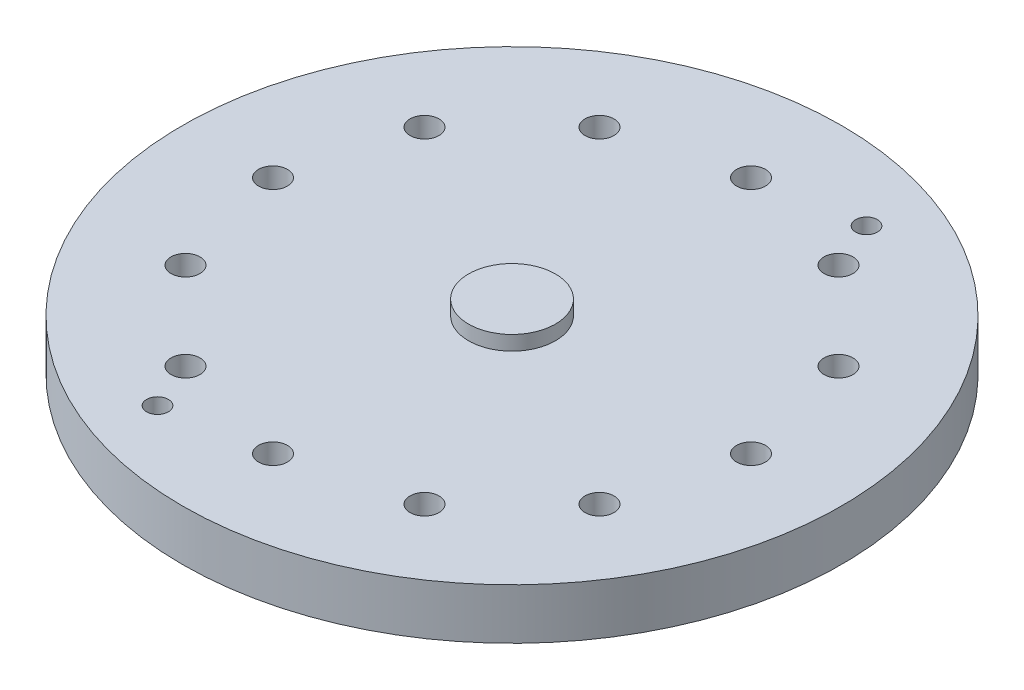
ISO-10303-21;
HEADER;
FILE_DESCRIPTION(('STEP AP214'),'2;1');
FILE_NAME('part.step','',(''),(''),'','','');
FILE_SCHEMA(('AUTOMOTIVE_DESIGN { 1 0 10303 214 1 1 1 1 }'));
ENDSEC;
DATA;
#1=APPLICATION_CONTEXT('core data for automotive mechanical design processes');
#2=APPLICATION_PROTOCOL_DEFINITION('international standard','automotive_design',2000,#1);
#3=PRODUCT_CONTEXT('',#1,'mechanical');
#4=PRODUCT('Part','Part','',(#3));
#5=PRODUCT_RELATED_PRODUCT_CATEGORY('part','',(#4));
#6=PRODUCT_DEFINITION_FORMATION('','',#4);
#7=PRODUCT_DEFINITION_CONTEXT('part definition',#1,'design');
#8=PRODUCT_DEFINITION('design','',#6,#7);
#9=PRODUCT_DEFINITION_SHAPE('','',#8);
#10=(LENGTH_UNIT() NAMED_UNIT(*) SI_UNIT(.MILLI.,.METRE.));
#11=(NAMED_UNIT(*) PLANE_ANGLE_UNIT() SI_UNIT($,.RADIAN.));
#12=(NAMED_UNIT(*) SI_UNIT($,.STERADIAN.) SOLID_ANGLE_UNIT());
#13=UNCERTAINTY_MEASURE_WITH_UNIT(LENGTH_MEASURE(1.E-05),#10,'distance_accuracy_value','');
#14=(GEOMETRIC_REPRESENTATION_CONTEXT(3) GLOBAL_UNCERTAINTY_ASSIGNED_CONTEXT((#13)) GLOBAL_UNIT_ASSIGNED_CONTEXT((#10,
#11,#12)) REPRESENTATION_CONTEXT('',''));
#15=CARTESIAN_POINT('',(0.,0.,0.));
#16=DIRECTION('',(0.,0.,1.));
#17=DIRECTION('',(1.,0.,0.));
#18=AXIS2_PLACEMENT_3D('',#15,#16,#17);
#19=CARTESIAN_POINT('',(-6.12,9.,-6.12));
#20=DIRECTION('',(0.,1.,0.));
#21=DIRECTION('',(0.,0.,1.));
#22=AXIS2_PLACEMENT_3D('',#19,#20,#21);
#23=PLANE('',#22);
#24=CARTESIAN_POINT('',(0.,9.,0.));
#25=DIRECTION('',(0.,-1.,0.));
#26=DIRECTION('',(0.,0.,-1.));
#27=AXIS2_PLACEMENT_3D('',#24,#25,#26);
#28=CIRCLE('',#27,6.);
#29=CARTESIAN_POINT('',(0.,9.,-6.));
#30=VERTEX_POINT('',#29);
#31=EDGE_CURVE('E19',#30,#30,#28,.T.);
#32=ORIENTED_EDGE('',*,*,#31,.F.);
#33=EDGE_LOOP('',(#32));
#34=FACE_BOUND('',#33,.T.);
#35=ADVANCED_FACE('F15',(#34),#23,.T.);
#36=CARTESIAN_POINT('',(0.,7.,0.));
#37=DIRECTION('',(0.,-1.,0.));
#38=DIRECTION('',(0.,0.,-1.));
#39=AXIS2_PLACEMENT_3D('',#36,#37,#38);
#40=CYLINDRICAL_SURFACE('',#39,45.5);
#41=CARTESIAN_POINT('',(0.,0.,0.));
#42=DIRECTION('',(0.,-1.,0.));
#43=DIRECTION('',(0.,0.,-1.));
#44=AXIS2_PLACEMENT_3D('',#41,#42,#43);
#45=CIRCLE('',#44,45.5);
#46=CARTESIAN_POINT('',(0.,0.,-45.5));
#47=VERTEX_POINT('',#46);
#48=EDGE_CURVE('E113',#47,#47,#45,.T.);
#49=ORIENTED_EDGE('',*,*,#48,.F.);
#50=EDGE_LOOP('',(#49));
#51=FACE_BOUND('',#50,.T.);
#52=CARTESIAN_POINT('',(0.,7.,0.));
#53=DIRECTION('',(0.,-1.,0.));
#54=DIRECTION('',(0.,0.,-1.));
#55=AXIS2_PLACEMENT_3D('',#52,#53,#54);
#56=CIRCLE('',#55,45.5);
#57=CARTESIAN_POINT('',(0.,7.,-45.5));
#58=VERTEX_POINT('',#57);
#59=EDGE_CURVE('E72',#58,#58,#56,.F.);
#60=ORIENTED_EDGE('',*,*,#59,.F.);
#61=EDGE_LOOP('',(#60));
#62=FACE_BOUND('',#61,.T.);
#63=ADVANCED_FACE('F123',(#51,#62),#40,.T.);
#64=CARTESIAN_POINT('',(13.7259968078408,0.,-35.2198383248865));
#65=DIRECTION('',(0.,1.,0.));
#66=DIRECTION('',(0.,0.,1.));
#67=AXIS2_PLACEMENT_3D('',#64,#65,#66);
#68=CYLINDRICAL_SURFACE('',#67,1.5);
#69=CARTESIAN_POINT('',(13.7259968078408,7.,-35.2198383248865));
#70=DIRECTION('',(0.,1.,0.));
#71=DIRECTION('',(0.,0.,1.));
#72=AXIS2_PLACEMENT_3D('',#69,#70,#71);
#73=CIRCLE('',#72,1.5);
#74=CARTESIAN_POINT('',(13.7259968078408,7.,-33.7198383248865));
#75=VERTEX_POINT('',#74);
#76=EDGE_CURVE('E69',#75,#75,#73,.F.);
#77=ORIENTED_EDGE('',*,*,#76,.F.);
#78=EDGE_LOOP('',(#77));
#79=FACE_BOUND('',#78,.T.);
#80=CARTESIAN_POINT('',(13.7259968078408,0.,-35.2198383248865));
#81=DIRECTION('',(0.,1.,0.));
#82=DIRECTION('',(0.,0.,1.));
#83=AXIS2_PLACEMENT_3D('',#80,#81,#82);
#84=CIRCLE('',#83,1.5);
#85=CARTESIAN_POINT('',(13.7259968078408,0.,-33.7198383248865));
#86=VERTEX_POINT('',#85);
#87=EDGE_CURVE('E111',#86,#86,#84,.T.);
#88=ORIENTED_EDGE('',*,*,#87,.F.);
#89=EDGE_LOOP('',(#88));
#90=FACE_BOUND('',#89,.T.);
#91=ADVANCED_FACE('F129',(#79,#90),#68,.F.);
#92=CARTESIAN_POINT('',(28.5788383248865,0.,-16.5000000000001));
#93=DIRECTION('',(0.,1.,0.));
#94=DIRECTION('',(0.,0.,1.));
#95=AXIS2_PLACEMENT_3D('',#92,#93,#94);
#96=CYLINDRICAL_SURFACE('',#95,1.99999999999992);
#97=CARTESIAN_POINT('',(28.5788383248865,7.,-16.5000000000001));
#98=DIRECTION('',(0.,1.,0.));
#99=DIRECTION('',(0.,0.,1.));
#100=AXIS2_PLACEMENT_3D('',#97,#98,#99);
#101=CIRCLE('',#100,1.99999999999992);
#102=CARTESIAN_POINT('',(28.5788383248865,7.,-14.5000000000001));
#103=VERTEX_POINT('',#102);
#104=EDGE_CURVE('E66',#103,#103,#101,.F.);
#105=ORIENTED_EDGE('',*,*,#104,.F.);
#106=EDGE_LOOP('',(#105));
#107=FACE_BOUND('',#106,.T.);
#108=CARTESIAN_POINT('',(28.5788383248865,0.,-16.5000000000001));
#109=DIRECTION('',(0.,1.,0.));
#110=DIRECTION('',(0.,0.,1.));
#111=AXIS2_PLACEMENT_3D('',#108,#109,#110);
#112=CIRCLE('',#111,1.99999999999992);
#113=CARTESIAN_POINT('',(28.5788383248865,0.,-14.5000000000001));
#114=VERTEX_POINT('',#113);
#115=EDGE_CURVE('E108',#114,#114,#112,.T.);
#116=ORIENTED_EDGE('',*,*,#115,.F.);
#117=EDGE_LOOP('',(#116));
#118=FACE_BOUND('',#117,.T.);
#119=ADVANCED_FACE('F195',(#107,#118),#96,.F.);
#120=CARTESIAN_POINT('',(16.5,0.,-28.5788383248865));
#121=DIRECTION('',(0.,1.,0.));
#122=DIRECTION('',(0.,0.,1.));
#123=AXIS2_PLACEMENT_3D('',#120,#121,#122);
#124=CYLINDRICAL_SURFACE('',#123,2.00000000000002);
#125=CARTESIAN_POINT('',(16.5,7.,-28.5788383248865));
#126=DIRECTION('',(0.,1.,0.));
#127=DIRECTION('',(0.,0.,1.));
#128=AXIS2_PLACEMENT_3D('',#125,#126,#127);
#129=CIRCLE('',#128,2.00000000000002);
#130=CARTESIAN_POINT('',(16.5,7.,-26.5788383248865));
#131=VERTEX_POINT('',#130);
#132=EDGE_CURVE('E63',#131,#131,#129,.F.);
#133=ORIENTED_EDGE('',*,*,#132,.F.);
#134=EDGE_LOOP('',(#133));
#135=FACE_BOUND('',#134,.T.);
#136=CARTESIAN_POINT('',(16.5,0.,-28.5788383248865));
#137=DIRECTION('',(0.,1.,0.));
#138=DIRECTION('',(0.,0.,1.));
#139=AXIS2_PLACEMENT_3D('',#136,#137,#138);
#140=CIRCLE('',#139,2.00000000000002);
#141=CARTESIAN_POINT('',(16.5,0.,-26.5788383248865));
#142=VERTEX_POINT('',#141);
#143=EDGE_CURVE('E105',#142,#142,#140,.T.);
#144=ORIENTED_EDGE('',*,*,#143,.F.);
#145=EDGE_LOOP('',(#144));
#146=FACE_BOUND('',#145,.T.);
#147=ADVANCED_FACE('F191',(#135,#146),#124,.F.);
#148=CARTESIAN_POINT('',(0.,0.,-33.));
#149=DIRECTION('',(0.,1.,0.));
#150=DIRECTION('',(0.,0.,1.));
#151=AXIS2_PLACEMENT_3D('',#148,#149,#150);
#152=CYLINDRICAL_SURFACE('',#151,2.);
#153=CARTESIAN_POINT('',(0.,7.,-33.));
#154=DIRECTION('',(0.,1.,0.));
#155=DIRECTION('',(0.,0.,1.));
#156=AXIS2_PLACEMENT_3D('',#153,#154,#155);
#157=CIRCLE('',#156,2.);
#158=CARTESIAN_POINT('',(0.,7.,-31.));
#159=VERTEX_POINT('',#158);
#160=EDGE_CURVE('E60',#159,#159,#157,.F.);
#161=ORIENTED_EDGE('',*,*,#160,.F.);
#162=EDGE_LOOP('',(#161));
#163=FACE_BOUND('',#162,.T.);
#164=CARTESIAN_POINT('',(0.,0.,-33.));
#165=DIRECTION('',(0.,1.,0.));
#166=DIRECTION('',(0.,0.,1.));
#167=AXIS2_PLACEMENT_3D('',#164,#165,#166);
#168=CIRCLE('',#167,2.);
#169=CARTESIAN_POINT('',(0.,0.,-31.));
#170=VERTEX_POINT('',#169);
#171=EDGE_CURVE('E102',#170,#170,#168,.T.);
#172=ORIENTED_EDGE('',*,*,#171,.F.);
#173=EDGE_LOOP('',(#172));
#174=FACE_BOUND('',#173,.T.);
#175=ADVANCED_FACE('F187',(#163,#174),#152,.F.);
#176=CARTESIAN_POINT('',(-16.5000000000001,0.,-28.5788383248865));
#177=DIRECTION('',(0.,1.,0.));
#178=DIRECTION('',(0.,0.,1.));
#179=AXIS2_PLACEMENT_3D('',#176,#177,#178);
#180=CYLINDRICAL_SURFACE('',#179,1.99999999999992);
#181=CARTESIAN_POINT('',(-16.5000000000001,7.,-28.5788383248865));
#182=DIRECTION('',(0.,1.,0.));
#183=DIRECTION('',(0.,0.,1.));
#184=AXIS2_PLACEMENT_3D('',#181,#182,#183);
#185=CIRCLE('',#184,1.99999999999992);
#186=CARTESIAN_POINT('',(-16.5000000000001,7.,-26.5788383248866));
#187=VERTEX_POINT('',#186);
#188=EDGE_CURVE('E57',#187,#187,#185,.F.);
#189=ORIENTED_EDGE('',*,*,#188,.F.);
#190=EDGE_LOOP('',(#189));
#191=FACE_BOUND('',#190,.T.);
#192=CARTESIAN_POINT('',(-16.5000000000001,0.,-28.5788383248865));
#193=DIRECTION('',(0.,1.,0.));
#194=DIRECTION('',(0.,0.,1.));
#195=AXIS2_PLACEMENT_3D('',#192,#193,#194);
#196=CIRCLE('',#195,1.99999999999992);
#197=CARTESIAN_POINT('',(-16.5000000000001,0.,-26.5788383248866));
#198=VERTEX_POINT('',#197);
#199=EDGE_CURVE('E99',#198,#198,#196,.T.);
#200=ORIENTED_EDGE('',*,*,#199,.F.);
#201=EDGE_LOOP('',(#200));
#202=FACE_BOUND('',#201,.T.);
#203=ADVANCED_FACE('F183',(#191,#202),#180,.F.);
#204=CARTESIAN_POINT('',(-28.5788383248865,0.,-16.5));
#205=DIRECTION('',(0.,1.,0.));
#206=DIRECTION('',(0.,0.,1.));
#207=AXIS2_PLACEMENT_3D('',#204,#205,#206);
#208=CYLINDRICAL_SURFACE('',#207,2.00000000000002);
#209=CARTESIAN_POINT('',(-28.5788383248865,7.,-16.5));
#210=DIRECTION('',(0.,1.,0.));
#211=DIRECTION('',(0.,0.,1.));
#212=AXIS2_PLACEMENT_3D('',#209,#210,#211);
#213=CIRCLE('',#212,2.00000000000002);
#214=CARTESIAN_POINT('',(-28.5788383248865,7.,-14.5));
#215=VERTEX_POINT('',#214);
#216=EDGE_CURVE('E54',#215,#215,#213,.F.);
#217=ORIENTED_EDGE('',*,*,#216,.F.);
#218=EDGE_LOOP('',(#217));
#219=FACE_BOUND('',#218,.T.);
#220=CARTESIAN_POINT('',(-28.5788383248865,0.,-16.5));
#221=DIRECTION('',(0.,1.,0.));
#222=DIRECTION('',(0.,0.,1.));
#223=AXIS2_PLACEMENT_3D('',#220,#221,#222);
#224=CIRCLE('',#223,2.00000000000002);
#225=CARTESIAN_POINT('',(-28.5788383248865,0.,-14.5));
#226=VERTEX_POINT('',#225);
#227=EDGE_CURVE('E96',#226,#226,#224,.T.);
#228=ORIENTED_EDGE('',*,*,#227,.F.);
#229=EDGE_LOOP('',(#228));
#230=FACE_BOUND('',#229,.T.);
#231=ADVANCED_FACE('F179',(#219,#230),#208,.F.);
#232=CARTESIAN_POINT('',(-33.,0.,0.));
#233=DIRECTION('',(0.,1.,0.));
#234=DIRECTION('',(0.,0.,1.));
#235=AXIS2_PLACEMENT_3D('',#232,#233,#234);
#236=CYLINDRICAL_SURFACE('',#235,2.);
#237=CARTESIAN_POINT('',(-33.,7.,0.));
#238=DIRECTION('',(0.,1.,0.));
#239=DIRECTION('',(0.,0.,1.));
#240=AXIS2_PLACEMENT_3D('',#237,#238,#239);
#241=CIRCLE('',#240,2.);
#242=CARTESIAN_POINT('',(-33.,7.,2.00000000000001));
#243=VERTEX_POINT('',#242);
#244=EDGE_CURVE('E51',#243,#243,#241,.F.);
#245=ORIENTED_EDGE('',*,*,#244,.F.);
#246=EDGE_LOOP('',(#245));
#247=FACE_BOUND('',#246,.T.);
#248=CARTESIAN_POINT('',(-33.,0.,0.));
#249=DIRECTION('',(0.,1.,0.));
#250=DIRECTION('',(0.,0.,1.));
#251=AXIS2_PLACEMENT_3D('',#248,#249,#250);
#252=CIRCLE('',#251,2.);
#253=CARTESIAN_POINT('',(-33.,0.,2.00000000000001));
#254=VERTEX_POINT('',#253);
#255=EDGE_CURVE('E93',#254,#254,#252,.T.);
#256=ORIENTED_EDGE('',*,*,#255,.F.);
#257=EDGE_LOOP('',(#256));
#258=FACE_BOUND('',#257,.T.);
#259=ADVANCED_FACE('F175',(#247,#258),#236,.F.);
#260=CARTESIAN_POINT('',(-28.5788383248865,0.,16.5000000000001));
#261=DIRECTION('',(0.,1.,0.));
#262=DIRECTION('',(0.,0.,1.));
#263=AXIS2_PLACEMENT_3D('',#260,#261,#262);
#264=CYLINDRICAL_SURFACE('',#263,1.99999999999992);
#265=CARTESIAN_POINT('',(-28.5788383248865,7.,16.5000000000001));
#266=DIRECTION('',(0.,1.,0.));
#267=DIRECTION('',(0.,0.,1.));
#268=AXIS2_PLACEMENT_3D('',#265,#266,#267);
#269=CIRCLE('',#268,1.99999999999992);
#270=CARTESIAN_POINT('',(-28.5788383248865,7.,18.5));
#271=VERTEX_POINT('',#270);
#272=EDGE_CURVE('E48',#271,#271,#269,.F.);
#273=ORIENTED_EDGE('',*,*,#272,.F.);
#274=EDGE_LOOP('',(#273));
#275=FACE_BOUND('',#274,.T.);
#276=CARTESIAN_POINT('',(-28.5788383248865,0.,16.5000000000001));
#277=DIRECTION('',(0.,1.,0.));
#278=DIRECTION('',(0.,0.,1.));
#279=AXIS2_PLACEMENT_3D('',#276,#277,#278);
#280=CIRCLE('',#279,1.99999999999992);
#281=CARTESIAN_POINT('',(-28.5788383248865,0.,18.5));
#282=VERTEX_POINT('',#281);
#283=EDGE_CURVE('E90',#282,#282,#280,.T.);
#284=ORIENTED_EDGE('',*,*,#283,.F.);
#285=EDGE_LOOP('',(#284));
#286=FACE_BOUND('',#285,.T.);
#287=ADVANCED_FACE('F171',(#275,#286),#264,.F.);
#288=CARTESIAN_POINT('',(-16.5,0.,28.5788383248865));
#289=DIRECTION('',(0.,1.,0.));
#290=DIRECTION('',(0.,0.,1.));
#291=AXIS2_PLACEMENT_3D('',#288,#289,#290);
#292=CYLINDRICAL_SURFACE('',#291,2.00000000000002);
#293=CARTESIAN_POINT('',(-16.5,7.,28.5788383248865));
#294=DIRECTION('',(0.,1.,0.));
#295=DIRECTION('',(0.,0.,1.));
#296=AXIS2_PLACEMENT_3D('',#293,#294,#295);
#297=CIRCLE('',#296,2.00000000000002);
#298=CARTESIAN_POINT('',(-16.5,7.,30.5788383248865));
#299=VERTEX_POINT('',#298);
#300=EDGE_CURVE('E45',#299,#299,#297,.F.);
#301=ORIENTED_EDGE('',*,*,#300,.F.);
#302=EDGE_LOOP('',(#301));
#303=FACE_BOUND('',#302,.T.);
#304=CARTESIAN_POINT('',(-16.5,0.,28.5788383248865));
#305=DIRECTION('',(0.,1.,0.));
#306=DIRECTION('',(0.,0.,1.));
#307=AXIS2_PLACEMENT_3D('',#304,#305,#306);
#308=CIRCLE('',#307,2.00000000000002);
#309=CARTESIAN_POINT('',(-16.5,0.,30.5788383248865));
#310=VERTEX_POINT('',#309);
#311=EDGE_CURVE('E87',#310,#310,#308,.T.);
#312=ORIENTED_EDGE('',*,*,#311,.F.);
#313=EDGE_LOOP('',(#312));
#314=FACE_BOUND('',#313,.T.);
#315=ADVANCED_FACE('F167',(#303,#314),#292,.F.);
#316=CARTESIAN_POINT('',(0.,0.,33.));
#317=DIRECTION('',(0.,1.,0.));
#318=DIRECTION('',(0.,0.,1.));
#319=AXIS2_PLACEMENT_3D('',#316,#317,#318);
#320=CYLINDRICAL_SURFACE('',#319,2.);
#321=CARTESIAN_POINT('',(0.,7.,33.));
#322=DIRECTION('',(0.,1.,0.));
#323=DIRECTION('',(0.,0.,1.));
#324=AXIS2_PLACEMENT_3D('',#321,#322,#323);
#325=CIRCLE('',#324,2.);
#326=CARTESIAN_POINT('',(0.,7.,35.));
#327=VERTEX_POINT('',#326);
#328=EDGE_CURVE('E42',#327,#327,#325,.F.);
#329=ORIENTED_EDGE('',*,*,#328,.F.);
#330=EDGE_LOOP('',(#329));
#331=FACE_BOUND('',#330,.T.);
#332=CARTESIAN_POINT('',(0.,0.,33.));
#333=DIRECTION('',(0.,1.,0.));
#334=DIRECTION('',(0.,0.,1.));
#335=AXIS2_PLACEMENT_3D('',#332,#333,#334);
#336=CIRCLE('',#335,2.);
#337=CARTESIAN_POINT('',(0.,0.,35.));
#338=VERTEX_POINT('',#337);
#339=EDGE_CURVE('E84',#338,#338,#336,.T.);
#340=ORIENTED_EDGE('',*,*,#339,.F.);
#341=EDGE_LOOP('',(#340));
#342=FACE_BOUND('',#341,.T.);
#343=ADVANCED_FACE('F163',(#331,#342),#320,.F.);
#344=CARTESIAN_POINT('',(16.5,0.,28.5788383248865));
#345=DIRECTION('',(0.,1.,0.));
#346=DIRECTION('',(0.,0.,1.));
#347=AXIS2_PLACEMENT_3D('',#344,#345,#346);
#348=CYLINDRICAL_SURFACE('',#347,2.00000000000002);
#349=CARTESIAN_POINT('',(16.5,7.,28.5788383248865));
#350=DIRECTION('',(0.,1.,0.));
#351=DIRECTION('',(0.,0.,1.));
#352=AXIS2_PLACEMENT_3D('',#349,#350,#351);
#353=CIRCLE('',#352,2.00000000000002);
#354=CARTESIAN_POINT('',(16.5,7.,30.5788383248865));
#355=VERTEX_POINT('',#354);
#356=EDGE_CURVE('E39',#355,#355,#353,.F.);
#357=ORIENTED_EDGE('',*,*,#356,.F.);
#358=EDGE_LOOP('',(#357));
#359=FACE_BOUND('',#358,.T.);
#360=CARTESIAN_POINT('',(16.5,0.,28.5788383248865));
#361=DIRECTION('',(0.,1.,0.));
#362=DIRECTION('',(0.,0.,1.));
#363=AXIS2_PLACEMENT_3D('',#360,#361,#362);
#364=CIRCLE('',#363,2.00000000000002);
#365=CARTESIAN_POINT('',(16.5,0.,30.5788383248865));
#366=VERTEX_POINT('',#365);
#367=EDGE_CURVE('E81',#366,#366,#364,.T.);
#368=ORIENTED_EDGE('',*,*,#367,.F.);
#369=EDGE_LOOP('',(#368));
#370=FACE_BOUND('',#369,.T.);
#371=ADVANCED_FACE('F159',(#359,#370),#348,.F.);
#372=CARTESIAN_POINT('',(28.5788383248865,0.,16.5));
#373=DIRECTION('',(0.,1.,0.));
#374=DIRECTION('',(0.,0.,1.));
#375=AXIS2_PLACEMENT_3D('',#372,#373,#374);
#376=CYLINDRICAL_SURFACE('',#375,2.00000000000002);
#377=CARTESIAN_POINT('',(28.5788383248865,7.,16.5));
#378=DIRECTION('',(0.,1.,0.));
#379=DIRECTION('',(0.,0.,1.));
#380=AXIS2_PLACEMENT_3D('',#377,#378,#379);
#381=CIRCLE('',#380,2.00000000000002);
#382=CARTESIAN_POINT('',(28.5788383248865,7.,18.5));
#383=VERTEX_POINT('',#382);
#384=EDGE_CURVE('E36',#383,#383,#381,.F.);
#385=ORIENTED_EDGE('',*,*,#384,.F.);
#386=EDGE_LOOP('',(#385));
#387=FACE_BOUND('',#386,.T.);
#388=CARTESIAN_POINT('',(28.5788383248865,0.,16.5));
#389=DIRECTION('',(0.,1.,0.));
#390=DIRECTION('',(0.,0.,1.));
#391=AXIS2_PLACEMENT_3D('',#388,#389,#390);
#392=CIRCLE('',#391,2.00000000000002);
#393=CARTESIAN_POINT('',(28.5788383248865,0.,18.5));
#394=VERTEX_POINT('',#393);
#395=EDGE_CURVE('E78',#394,#394,#392,.T.);
#396=ORIENTED_EDGE('',*,*,#395,.F.);
#397=EDGE_LOOP('',(#396));
#398=FACE_BOUND('',#397,.T.);
#399=ADVANCED_FACE('F155',(#387,#398),#376,.F.);
#400=CARTESIAN_POINT('',(33.,0.,0.));
#401=DIRECTION('',(0.,1.,0.));
#402=DIRECTION('',(0.,0.,1.));
#403=AXIS2_PLACEMENT_3D('',#400,#401,#402);
#404=CYLINDRICAL_SURFACE('',#403,2.);
#405=CARTESIAN_POINT('',(33.,7.,0.));
#406=DIRECTION('',(0.,1.,0.));
#407=DIRECTION('',(0.,0.,1.));
#408=AXIS2_PLACEMENT_3D('',#405,#406,#407);
#409=CIRCLE('',#408,2.);
#410=CARTESIAN_POINT('',(33.,7.,2.));
#411=VERTEX_POINT('',#410);
#412=EDGE_CURVE('E33',#411,#411,#409,.F.);
#413=ORIENTED_EDGE('',*,*,#412,.F.);
#414=EDGE_LOOP('',(#413));
#415=FACE_BOUND('',#414,.T.);
#416=CARTESIAN_POINT('',(33.,0.,0.));
#417=DIRECTION('',(0.,1.,0.));
#418=DIRECTION('',(0.,0.,1.));
#419=AXIS2_PLACEMENT_3D('',#416,#417,#418);
#420=CIRCLE('',#419,2.);
#421=CARTESIAN_POINT('',(33.,0.,2.));
#422=VERTEX_POINT('',#421);
#423=EDGE_CURVE('E75',#422,#422,#420,.T.);
#424=ORIENTED_EDGE('',*,*,#423,.F.);
#425=EDGE_LOOP('',(#424));
#426=FACE_BOUND('',#425,.T.);
#427=ADVANCED_FACE('F148',(#415,#426),#404,.F.);
#428=CARTESIAN_POINT('',(0.,9.,0.));
#429=DIRECTION('',(0.,-1.,0.));
#430=DIRECTION('',(0.,0.,-1.));
#431=AXIS2_PLACEMENT_3D('',#428,#429,#430);
#432=CYLINDRICAL_SURFACE('',#431,6.);
#433=CARTESIAN_POINT('',(0.,7.,0.));
#434=DIRECTION('',(0.,-1.,0.));
#435=DIRECTION('',(0.,0.,-1.));
#436=AXIS2_PLACEMENT_3D('',#433,#434,#435);
#437=CIRCLE('',#436,6.);
#438=CARTESIAN_POINT('',(0.,7.,-6.));
#439=VERTEX_POINT('',#438);
#440=EDGE_CURVE('E28',#439,#439,#437,.T.);
#441=ORIENTED_EDGE('',*,*,#440,.F.);
#442=EDGE_LOOP('',(#441));
#443=FACE_BOUND('',#442,.T.);
#444=ORIENTED_EDGE('',*,*,#31,.T.);
#445=EDGE_LOOP('',(#444));
#446=FACE_BOUND('',#445,.T.);
#447=ADVANCED_FACE('F120',(#443,#446),#432,.T.);
#448=CARTESIAN_POINT('',(-45.5,0.,46.41));
#449=DIRECTION('',(0.,-1.,0.));
#450=DIRECTION('',(0.,0.,-1.));
#451=AXIS2_PLACEMENT_3D('',#448,#449,#450);
#452=PLANE('',#451);
#453=ORIENTED_EDGE('',*,*,#423,.T.);
#454=EDGE_LOOP('',(#453));
#455=FACE_BOUND('',#454,.T.);
#456=ORIENTED_EDGE('',*,*,#395,.T.);
#457=EDGE_LOOP('',(#456));
#458=FACE_BOUND('',#457,.T.);
#459=ORIENTED_EDGE('',*,*,#367,.T.);
#460=EDGE_LOOP('',(#459));
#461=FACE_BOUND('',#460,.T.);
#462=ORIENTED_EDGE('',*,*,#339,.T.);
#463=EDGE_LOOP('',(#462));
#464=FACE_BOUND('',#463,.T.);
#465=ORIENTED_EDGE('',*,*,#311,.T.);
#466=EDGE_LOOP('',(#465));
#467=FACE_BOUND('',#466,.T.);
#468=ORIENTED_EDGE('',*,*,#283,.T.);
#469=EDGE_LOOP('',(#468));
#470=FACE_BOUND('',#469,.T.);
#471=ORIENTED_EDGE('',*,*,#255,.T.);
#472=EDGE_LOOP('',(#471));
#473=FACE_BOUND('',#472,.T.);
#474=ORIENTED_EDGE('',*,*,#227,.T.);
#475=EDGE_LOOP('',(#474));
#476=FACE_BOUND('',#475,.T.);
#477=ORIENTED_EDGE('',*,*,#199,.T.);
#478=EDGE_LOOP('',(#477));
#479=FACE_BOUND('',#478,.T.);
#480=ORIENTED_EDGE('',*,*,#171,.T.);
#481=EDGE_LOOP('',(#480));
#482=FACE_BOUND('',#481,.T.);
#483=ORIENTED_EDGE('',*,*,#143,.T.);
#484=EDGE_LOOP('',(#483));
#485=FACE_BOUND('',#484,.T.);
#486=ORIENTED_EDGE('',*,*,#115,.T.);
#487=EDGE_LOOP('',(#486));
#488=FACE_BOUND('',#487,.T.);
#489=ORIENTED_EDGE('',*,*,#87,.T.);
#490=EDGE_LOOP('',(#489));
#491=FACE_BOUND('',#490,.T.);
#492=CARTESIAN_POINT('',(-13.7259968078408,0.,35.2198383248865));
#493=DIRECTION('',(0.,1.,0.));
#494=DIRECTION('',(0.,0.,1.));
#495=AXIS2_PLACEMENT_3D('',#492,#493,#494);
#496=CIRCLE('',#495,1.5);
#497=CARTESIAN_POINT('',(-13.7259968078408,0.,36.7198383248865));
#498=VERTEX_POINT('',#497);
#499=EDGE_CURVE('E23',#498,#498,#496,.F.);
#500=ORIENTED_EDGE('',*,*,#499,.F.);
#501=EDGE_LOOP('',(#500));
#502=FACE_BOUND('',#501,.T.);
#503=ORIENTED_EDGE('',*,*,#48,.T.);
#504=EDGE_LOOP('',(#503));
#505=FACE_BOUND('',#504,.T.);
#506=ADVANCED_FACE('F137',(#455,#458,#461,#464,#467,#470,#473,#476,#479,#482,#485,#488,#491,
#502,#505),#452,.T.);
#507=CARTESIAN_POINT('',(-45.5,7.,-46.41));
#508=DIRECTION('',(0.,1.,0.));
#509=DIRECTION('',(0.,0.,1.));
#510=AXIS2_PLACEMENT_3D('',#507,#508,#509);
#511=PLANE('',#510);
#512=ORIENTED_EDGE('',*,*,#440,.T.);
#513=EDGE_LOOP('',(#512));
#514=FACE_BOUND('',#513,.T.);
#515=ORIENTED_EDGE('',*,*,#412,.T.);
#516=EDGE_LOOP('',(#515));
#517=FACE_BOUND('',#516,.T.);
#518=ORIENTED_EDGE('',*,*,#384,.T.);
#519=EDGE_LOOP('',(#518));
#520=FACE_BOUND('',#519,.T.);
#521=ORIENTED_EDGE('',*,*,#356,.T.);
#522=EDGE_LOOP('',(#521));
#523=FACE_BOUND('',#522,.T.);
#524=ORIENTED_EDGE('',*,*,#328,.T.);
#525=EDGE_LOOP('',(#524));
#526=FACE_BOUND('',#525,.T.);
#527=ORIENTED_EDGE('',*,*,#300,.T.);
#528=EDGE_LOOP('',(#527));
#529=FACE_BOUND('',#528,.T.);
#530=ORIENTED_EDGE('',*,*,#272,.T.);
#531=EDGE_LOOP('',(#530));
#532=FACE_BOUND('',#531,.T.);
#533=ORIENTED_EDGE('',*,*,#244,.T.);
#534=EDGE_LOOP('',(#533));
#535=FACE_BOUND('',#534,.T.);
#536=ORIENTED_EDGE('',*,*,#216,.T.);
#537=EDGE_LOOP('',(#536));
#538=FACE_BOUND('',#537,.T.);
#539=ORIENTED_EDGE('',*,*,#188,.T.);
#540=EDGE_LOOP('',(#539));
#541=FACE_BOUND('',#540,.T.);
#542=ORIENTED_EDGE('',*,*,#160,.T.);
#543=EDGE_LOOP('',(#542));
#544=FACE_BOUND('',#543,.T.);
#545=ORIENTED_EDGE('',*,*,#132,.T.);
#546=EDGE_LOOP('',(#545));
#547=FACE_BOUND('',#546,.T.);
#548=ORIENTED_EDGE('',*,*,#104,.T.);
#549=EDGE_LOOP('',(#548));
#550=FACE_BOUND('',#549,.T.);
#551=ORIENTED_EDGE('',*,*,#76,.T.);
#552=EDGE_LOOP('',(#551));
#553=FACE_BOUND('',#552,.T.);
#554=CARTESIAN_POINT('',(-13.7259968078408,7.,35.2198383248865));
#555=DIRECTION('',(0.,1.,0.));
#556=DIRECTION('',(0.,0.,1.));
#557=AXIS2_PLACEMENT_3D('',#554,#555,#556);
#558=CIRCLE('',#557,1.5);
#559=CARTESIAN_POINT('',(-13.7259968078408,7.,36.7198383248865));
#560=VERTEX_POINT('',#559);
#561=EDGE_CURVE('E10',#560,#560,#558,.T.);
#562=ORIENTED_EDGE('',*,*,#561,.F.);
#563=EDGE_LOOP('',(#562));
#564=FACE_BOUND('',#563,.T.);
#565=ORIENTED_EDGE('',*,*,#59,.T.);
#566=EDGE_LOOP('',(#565));
#567=FACE_BOUND('',#566,.T.);
#568=ADVANCED_FACE('F133',(#514,#517,#520,#523,#526,#529,#532,#535,#538,#541,#544,#547,#550,
#553,#564,#567),#511,.T.);
#569=CARTESIAN_POINT('',(-13.7259968078408,0.,35.2198383248865));
#570=DIRECTION('',(0.,1.,0.));
#571=DIRECTION('',(0.,0.,1.));
#572=AXIS2_PLACEMENT_3D('',#569,#570,#571);
#573=CYLINDRICAL_SURFACE('',#572,1.5);
#574=ORIENTED_EDGE('',*,*,#561,.T.);
#575=EDGE_LOOP('',(#574));
#576=FACE_BOUND('',#575,.T.);
#577=ORIENTED_EDGE('',*,*,#499,.T.);
#578=EDGE_LOOP('',(#577));
#579=FACE_BOUND('',#578,.T.);
#580=ADVANCED_FACE('F17',(#576,#579),#573,.F.);
#581=CLOSED_SHELL('',(#35,#63,#91,#119,#147,#175,#203,#231,#259,#287,#315,#343,#371,#399,#427,
#447,#506,#568,#580));
#582=MANIFOLD_SOLID_BREP('B1',#581);
#583=ADVANCED_BREP_SHAPE_REPRESENTATION('',(#18,#582),#14);
#584=SHAPE_DEFINITION_REPRESENTATION(#9,#583);
ENDSEC;
END-ISO-10303-21;
